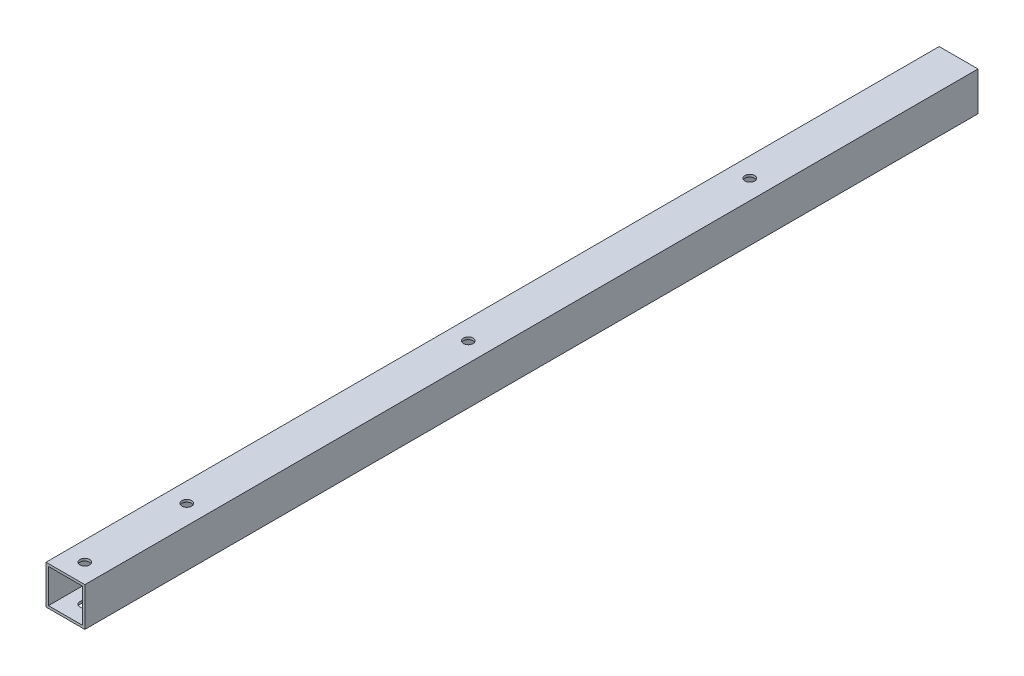
ISO-10303-21;
HEADER;
FILE_DESCRIPTION(('STEP AP214'),'2;1');
FILE_NAME('part.step','',(''),(''),'','','');
FILE_SCHEMA(('AUTOMOTIVE_DESIGN { 1 0 10303 214 1 1 1 1 }'));
ENDSEC;
DATA;
#1=APPLICATION_CONTEXT('core data for automotive mechanical design processes');
#2=APPLICATION_PROTOCOL_DEFINITION('international standard','automotive_design',2000,#1);
#3=PRODUCT_CONTEXT('',#1,'mechanical');
#4=PRODUCT('Part','Part','',(#3));
#5=PRODUCT_RELATED_PRODUCT_CATEGORY('part','',(#4));
#6=PRODUCT_DEFINITION_FORMATION('','',#4);
#7=PRODUCT_DEFINITION_CONTEXT('part definition',#1,'design');
#8=PRODUCT_DEFINITION('design','',#6,#7);
#9=PRODUCT_DEFINITION_SHAPE('','',#8);
#10=(LENGTH_UNIT() NAMED_UNIT(*) SI_UNIT(.MILLI.,.METRE.));
#11=(NAMED_UNIT(*) PLANE_ANGLE_UNIT() SI_UNIT($,.RADIAN.));
#12=(NAMED_UNIT(*) SI_UNIT($,.STERADIAN.) SOLID_ANGLE_UNIT());
#13=UNCERTAINTY_MEASURE_WITH_UNIT(LENGTH_MEASURE(1.E-05),#10,'distance_accuracy_value','');
#14=(GEOMETRIC_REPRESENTATION_CONTEXT(3) GLOBAL_UNCERTAINTY_ASSIGNED_CONTEXT((#13)) GLOBAL_UNIT_ASSIGNED_CONTEXT((#10,
#11,#12)) REPRESENTATION_CONTEXT('',''));
#15=CARTESIAN_POINT('',(0.,0.,0.));
#16=DIRECTION('',(0.,0.,1.));
#17=DIRECTION('',(1.,0.,0.));
#18=AXIS2_PLACEMENT_3D('',#15,#16,#17);
#19=CARTESIAN_POINT('',(-539.75,330.2,-50.8));
#20=DIRECTION('',(-1.,0.,0.));
#21=DIRECTION('',(0.,0.,1.));
#22=AXIS2_PLACEMENT_3D('',#19,#20,#21);
#23=PLANE('',#22);
#24=DIRECTION('',(0.,0.,1.));
#25=VECTOR('',#24,1.);
#26=CARTESIAN_POINT('',(-539.75,279.4,-50.8));
#27=LINE('',#26,#25);
#28=CARTESIAN_POINT('',(-539.75,279.4,-50.8));
#29=VERTEX_POINT('',#28);
#30=CARTESIAN_POINT('',(-539.75,279.4,1117.6));
#31=VERTEX_POINT('',#30);
#32=EDGE_CURVE('E188',#29,#31,#27,.T.);
#33=ORIENTED_EDGE('',*,*,#32,.T.);
#34=DIRECTION('',(0.,-1.,0.));
#35=VECTOR('',#34,1.);
#36=CARTESIAN_POINT('',(-539.75,330.2,1117.6));
#37=LINE('',#36,#35);
#38=CARTESIAN_POINT('',(-539.75,330.2,1117.6));
#39=VERTEX_POINT('',#38);
#40=EDGE_CURVE('E145',#39,#31,#37,.T.);
#41=ORIENTED_EDGE('',*,*,#40,.F.);
#42=DIRECTION('',(0.,0.,1.));
#43=VECTOR('',#42,1.);
#44=CARTESIAN_POINT('',(-539.75,330.2,-50.8));
#45=LINE('',#44,#43);
#46=CARTESIAN_POINT('',(-539.75,330.2,-50.8));
#47=VERTEX_POINT('',#46);
#48=EDGE_CURVE('E11',#47,#39,#45,.T.);
#49=ORIENTED_EDGE('',*,*,#48,.F.);
#50=DIRECTION('',(0.,-1.,0.));
#51=VECTOR('',#50,1.);
#52=CARTESIAN_POINT('',(-539.75,330.2,-50.8));
#53=LINE('',#52,#51);
#54=EDGE_CURVE('E170',#47,#29,#53,.T.);
#55=ORIENTED_EDGE('',*,*,#54,.T.);
#56=EDGE_LOOP('',(#33,#41,#49,#55));
#57=FACE_BOUND('',#56,.T.);
#58=ADVANCED_FACE('F38',(#57),#23,.T.);
#59=CARTESIAN_POINT('',(-539.75,330.2,-50.8));
#60=DIRECTION('',(0.,1.,0.));
#61=DIRECTION('',(0.,0.,1.));
#62=AXIS2_PLACEMENT_3D('',#59,#60,#61);
#63=PLANE('',#62);
#64=CARTESIAN_POINT('',(-514.35,330.2,222.25));
#65=DIRECTION('',(0.,1.,0.));
#66=DIRECTION('',(0.,0.,1.));
#67=AXIS2_PLACEMENT_3D('',#64,#65,#66);
#68=CIRCLE('',#67,6.34999999999994);
#69=CARTESIAN_POINT('',(-514.35,330.2,228.6));
#70=VERTEX_POINT('',#69);
#71=EDGE_CURVE('E383',#70,#70,#68,.T.);
#72=ORIENTED_EDGE('',*,*,#71,.F.);
#73=EDGE_LOOP('',(#72));
#74=FACE_BOUND('',#73,.T.);
#75=CARTESIAN_POINT('',(-514.35,330.2,590.55));
#76=DIRECTION('',(0.,1.,0.));
#77=DIRECTION('',(0.,0.,1.));
#78=AXIS2_PLACEMENT_3D('',#75,#76,#77);
#79=CIRCLE('',#78,6.34999999999994);
#80=CARTESIAN_POINT('',(-514.35,330.2,596.9));
#81=VERTEX_POINT('',#80);
#82=EDGE_CURVE('E219',#81,#81,#79,.T.);
#83=ORIENTED_EDGE('',*,*,#82,.F.);
#84=EDGE_LOOP('',(#83));
#85=FACE_BOUND('',#84,.T.);
#86=CARTESIAN_POINT('',(-514.35,330.2,958.85));
#87=DIRECTION('',(0.,1.,0.));
#88=DIRECTION('',(0.,0.,1.));
#89=AXIS2_PLACEMENT_3D('',#86,#87,#88);
#90=CIRCLE('',#89,6.34999999999994);
#91=CARTESIAN_POINT('',(-514.35,330.2,965.2));
#92=VERTEX_POINT('',#91);
#93=EDGE_CURVE('E216',#92,#92,#90,.T.);
#94=ORIENTED_EDGE('',*,*,#93,.F.);
#95=EDGE_LOOP('',(#94));
#96=FACE_BOUND('',#95,.T.);
#97=CARTESIAN_POINT('',(-514.35,330.2,1092.2));
#98=DIRECTION('',(0.,1.,0.));
#99=DIRECTION('',(0.,0.,1.));
#100=AXIS2_PLACEMENT_3D('',#97,#98,#99);
#101=CIRCLE('',#100,6.34999999999994);
#102=CARTESIAN_POINT('',(-514.35,330.2,1098.55));
#103=VERTEX_POINT('',#102);
#104=EDGE_CURVE('E238',#103,#103,#101,.T.);
#105=ORIENTED_EDGE('',*,*,#104,.F.);
#106=EDGE_LOOP('',(#105));
#107=FACE_BOUND('',#106,.T.);
#108=ORIENTED_EDGE('',*,*,#48,.T.);
#109=DIRECTION('',(-1.,0.,0.));
#110=VECTOR('',#109,1.);
#111=CARTESIAN_POINT('',(-539.75,330.2,1117.6));
#112=LINE('',#111,#110);
#113=CARTESIAN_POINT('',(-488.95,330.2,1117.6));
#114=VERTEX_POINT('',#113);
#115=EDGE_CURVE('E155',#114,#39,#112,.T.);
#116=ORIENTED_EDGE('',*,*,#115,.F.);
#117=DIRECTION('',(0.,0.,1.));
#118=VECTOR('',#117,1.);
#119=CARTESIAN_POINT('',(-488.95,330.2,-50.8));
#120=LINE('',#119,#118);
#121=CARTESIAN_POINT('',(-488.95,330.2,-50.8));
#122=VERTEX_POINT('',#121);
#123=EDGE_CURVE('E47',#122,#114,#120,.T.);
#124=ORIENTED_EDGE('',*,*,#123,.F.);
#125=DIRECTION('',(-1.,0.,0.));
#126=VECTOR('',#125,1.);
#127=CARTESIAN_POINT('',(-539.75,330.2,-50.8));
#128=LINE('',#127,#126);
#129=EDGE_CURVE('E186',#122,#47,#128,.T.);
#130=ORIENTED_EDGE('',*,*,#129,.T.);
#131=EDGE_LOOP('',(#108,#116,#124,#130));
#132=FACE_BOUND('',#131,.T.);
#133=ADVANCED_FACE('F265',(#74,#85,#96,#107,#132),#63,.T.);
#134=CARTESIAN_POINT('',(-488.95,330.2,-50.8));
#135=DIRECTION('',(1.,0.,0.));
#136=DIRECTION('',(0.,0.,-1.));
#137=AXIS2_PLACEMENT_3D('',#134,#135,#136);
#138=PLANE('',#137);
#139=ORIENTED_EDGE('',*,*,#123,.T.);
#140=DIRECTION('',(0.,1.,0.));
#141=VECTOR('',#140,1.);
#142=CARTESIAN_POINT('',(-488.95,330.2,1117.6));
#143=LINE('',#142,#141);
#144=CARTESIAN_POINT('',(-488.95,279.4,1117.6));
#145=VERTEX_POINT('',#144);
#146=EDGE_CURVE('E151',#145,#114,#143,.T.);
#147=ORIENTED_EDGE('',*,*,#146,.F.);
#148=DIRECTION('',(0.,0.,1.));
#149=VECTOR('',#148,1.);
#150=CARTESIAN_POINT('',(-488.95,279.4,-50.8));
#151=LINE('',#150,#149);
#152=CARTESIAN_POINT('',(-488.95,279.4,-50.8));
#153=VERTEX_POINT('',#152);
#154=EDGE_CURVE('E192',#153,#145,#151,.T.);
#155=ORIENTED_EDGE('',*,*,#154,.F.);
#156=DIRECTION('',(0.,1.,0.));
#157=VECTOR('',#156,1.);
#158=CARTESIAN_POINT('',(-488.95,330.2,-50.8));
#159=LINE('',#158,#157);
#160=EDGE_CURVE('E182',#153,#122,#159,.T.);
#161=ORIENTED_EDGE('',*,*,#160,.T.);
#162=EDGE_LOOP('',(#139,#147,#155,#161));
#163=FACE_BOUND('',#162,.T.);
#164=ADVANCED_FACE('F269',(#163),#138,.T.);
#165=CARTESIAN_POINT('',(-539.75,279.4,-50.8));
#166=DIRECTION('',(0.,-1.,0.));
#167=DIRECTION('',(0.,0.,-1.));
#168=AXIS2_PLACEMENT_3D('',#165,#166,#167);
#169=PLANE('',#168);
#170=CARTESIAN_POINT('',(-514.35,279.4,222.25));
#171=DIRECTION('',(0.,1.,0.));
#172=DIRECTION('',(0.,0.,1.));
#173=AXIS2_PLACEMENT_3D('',#170,#171,#172);
#174=CIRCLE('',#173,6.34999999999994);
#175=CARTESIAN_POINT('',(-514.35,279.4,228.6));
#176=VERTEX_POINT('',#175);
#177=EDGE_CURVE('E389',#176,#176,#174,.T.);
#178=ORIENTED_EDGE('',*,*,#177,.T.);
#179=EDGE_LOOP('',(#178));
#180=FACE_BOUND('',#179,.T.);
#181=CARTESIAN_POINT('',(-514.35,279.4,590.55));
#182=DIRECTION('',(0.,1.,0.));
#183=DIRECTION('',(0.,0.,1.));
#184=AXIS2_PLACEMENT_3D('',#181,#182,#183);
#185=CIRCLE('',#184,6.34999999999994);
#186=CARTESIAN_POINT('',(-514.35,279.4,596.9));
#187=VERTEX_POINT('',#186);
#188=EDGE_CURVE('E209',#187,#187,#185,.T.);
#189=ORIENTED_EDGE('',*,*,#188,.T.);
#190=EDGE_LOOP('',(#189));
#191=FACE_BOUND('',#190,.T.);
#192=CARTESIAN_POINT('',(-514.35,279.4,958.85));
#193=DIRECTION('',(0.,1.,0.));
#194=DIRECTION('',(0.,0.,1.));
#195=AXIS2_PLACEMENT_3D('',#192,#193,#194);
#196=CIRCLE('',#195,6.34999999999994);
#197=CARTESIAN_POINT('',(-514.35,279.4,965.2));
#198=VERTEX_POINT('',#197);
#199=EDGE_CURVE('E204',#198,#198,#196,.T.);
#200=ORIENTED_EDGE('',*,*,#199,.T.);
#201=EDGE_LOOP('',(#200));
#202=FACE_BOUND('',#201,.T.);
#203=CARTESIAN_POINT('',(-514.35,279.4,1092.2));
#204=DIRECTION('',(0.,1.,0.));
#205=DIRECTION('',(0.,0.,1.));
#206=AXIS2_PLACEMENT_3D('',#203,#204,#205);
#207=CIRCLE('',#206,6.34999999999994);
#208=CARTESIAN_POINT('',(-514.35,279.4,1098.55));
#209=VERTEX_POINT('',#208);
#210=EDGE_CURVE('E200',#209,#209,#207,.T.);
#211=ORIENTED_EDGE('',*,*,#210,.T.);
#212=EDGE_LOOP('',(#211));
#213=FACE_BOUND('',#212,.T.);
#214=ORIENTED_EDGE('',*,*,#154,.T.);
#215=DIRECTION('',(1.,0.,0.));
#216=VECTOR('',#215,1.);
#217=CARTESIAN_POINT('',(-539.75,279.4,1117.6));
#218=LINE('',#217,#216);
#219=EDGE_CURVE('E148',#31,#145,#218,.T.);
#220=ORIENTED_EDGE('',*,*,#219,.F.);
#221=ORIENTED_EDGE('',*,*,#32,.F.);
#222=DIRECTION('',(1.,0.,0.));
#223=VECTOR('',#222,1.);
#224=CARTESIAN_POINT('',(-539.75,279.4,-50.8));
#225=LINE('',#224,#223);
#226=EDGE_CURVE('E178',#29,#153,#225,.T.);
#227=ORIENTED_EDGE('',*,*,#226,.T.);
#228=EDGE_LOOP('',(#214,#220,#221,#227));
#229=FACE_BOUND('',#228,.T.);
#230=ADVANCED_FACE('F275',(#180,#191,#202,#213,#229),#169,.T.);
#231=CARTESIAN_POINT('',(-539.75,279.4,-50.8));
#232=DIRECTION('',(0.,0.,1.));
#233=DIRECTION('',(1.,0.,0.));
#234=AXIS2_PLACEMENT_3D('',#231,#232,#233);
#235=PLANE('',#234);
#236=DIRECTION('',(-1.,0.,0.));
#237=VECTOR('',#236,1.);
#238=CARTESIAN_POINT('',(-536.575,327.025,-50.8));
#239=LINE('',#238,#237);
#240=CARTESIAN_POINT('',(-492.125,327.025,-50.8));
#241=VERTEX_POINT('',#240);
#242=CARTESIAN_POINT('',(-536.575,327.025,-50.8));
#243=VERTEX_POINT('',#242);
#244=EDGE_CURVE('E123',#241,#243,#239,.T.);
#245=ORIENTED_EDGE('',*,*,#244,.T.);
#246=DIRECTION('',(0.,-1.,0.));
#247=VECTOR('',#246,1.);
#248=CARTESIAN_POINT('',(-536.575,327.025,-50.8));
#249=LINE('',#248,#247);
#250=CARTESIAN_POINT('',(-536.575,282.575,-50.8));
#251=VERTEX_POINT('',#250);
#252=EDGE_CURVE('E159',#243,#251,#249,.T.);
#253=ORIENTED_EDGE('',*,*,#252,.T.);
#254=DIRECTION('',(1.,0.,0.));
#255=VECTOR('',#254,1.);
#256=CARTESIAN_POINT('',(-536.575,282.575,-50.8));
#257=LINE('',#256,#255);
#258=CARTESIAN_POINT('',(-492.125,282.575,-50.8));
#259=VERTEX_POINT('',#258);
#260=EDGE_CURVE('E117',#251,#259,#257,.T.);
#261=ORIENTED_EDGE('',*,*,#260,.T.);
#262=DIRECTION('',(0.,1.,0.));
#263=VECTOR('',#262,1.);
#264=CARTESIAN_POINT('',(-492.125,327.025,-50.8));
#265=LINE('',#264,#263);
#266=EDGE_CURVE('E58',#259,#241,#265,.T.);
#267=ORIENTED_EDGE('',*,*,#266,.T.);
#268=EDGE_LOOP('',(#245,#253,#261,#267));
#269=FACE_BOUND('',#268,.T.);
#270=ORIENTED_EDGE('',*,*,#54,.F.);
#271=ORIENTED_EDGE('',*,*,#129,.F.);
#272=ORIENTED_EDGE('',*,*,#160,.F.);
#273=ORIENTED_EDGE('',*,*,#226,.F.);
#274=EDGE_LOOP('',(#270,#271,#272,#273));
#275=FACE_BOUND('',#274,.T.);
#276=ADVANCED_FACE('F283',(#269,#275),#235,.F.);
#277=CARTESIAN_POINT('',(-536.575,327.025,-50.8));
#278=DIRECTION('',(-1.,0.,0.));
#279=DIRECTION('',(0.,0.,1.));
#280=AXIS2_PLACEMENT_3D('',#277,#278,#279);
#281=PLANE('',#280);
#282=DIRECTION('',(0.,0.,1.));
#283=VECTOR('',#282,1.);
#284=CARTESIAN_POINT('',(-536.575,327.025,-50.8));
#285=LINE('',#284,#283);
#286=CARTESIAN_POINT('',(-536.575,327.025,1117.6));
#287=VERTEX_POINT('',#286);
#288=EDGE_CURVE('E128',#243,#287,#285,.T.);
#289=ORIENTED_EDGE('',*,*,#288,.T.);
#290=DIRECTION('',(0.,-1.,0.));
#291=VECTOR('',#290,1.);
#292=CARTESIAN_POINT('',(-536.575,327.025,1117.6));
#293=LINE('',#292,#291);
#294=CARTESIAN_POINT('',(-536.575,282.575,1117.6));
#295=VERTEX_POINT('',#294);
#296=EDGE_CURVE('E126',#287,#295,#293,.T.);
#297=ORIENTED_EDGE('',*,*,#296,.T.);
#298=DIRECTION('',(0.,0.,1.));
#299=VECTOR('',#298,1.);
#300=CARTESIAN_POINT('',(-536.575,282.575,-50.8));
#301=LINE('',#300,#299);
#302=EDGE_CURVE('E110',#251,#295,#301,.T.);
#303=ORIENTED_EDGE('',*,*,#302,.F.);
#304=ORIENTED_EDGE('',*,*,#252,.F.);
#305=EDGE_LOOP('',(#289,#297,#303,#304));
#306=FACE_BOUND('',#305,.T.);
#307=ADVANCED_FACE('F127',(#306),#281,.F.);
#308=CARTESIAN_POINT('',(-536.575,327.025,-50.8));
#309=DIRECTION('',(0.,1.,0.));
#310=DIRECTION('',(0.,0.,1.));
#311=AXIS2_PLACEMENT_3D('',#308,#309,#310);
#312=PLANE('',#311);
#313=CARTESIAN_POINT('',(-514.35,327.025,222.25));
#314=DIRECTION('',(0.,1.,0.));
#315=DIRECTION('',(0.,0.,1.));
#316=AXIS2_PLACEMENT_3D('',#313,#314,#315);
#317=CIRCLE('',#316,6.34999999999994);
#318=CARTESIAN_POINT('',(-514.35,327.025,228.6));
#319=VERTEX_POINT('',#318);
#320=EDGE_CURVE('E225',#319,#319,#317,.T.);
#321=ORIENTED_EDGE('',*,*,#320,.T.);
#322=EDGE_LOOP('',(#321));
#323=FACE_BOUND('',#322,.T.);
#324=CARTESIAN_POINT('',(-514.35,327.025,590.55));
#325=DIRECTION('',(0.,1.,0.));
#326=DIRECTION('',(0.,0.,1.));
#327=AXIS2_PLACEMENT_3D('',#324,#325,#326);
#328=CIRCLE('',#327,6.34999999999994);
#329=CARTESIAN_POINT('',(-514.35,327.025,596.9));
#330=VERTEX_POINT('',#329);
#331=EDGE_CURVE('E208',#330,#330,#328,.T.);
#332=ORIENTED_EDGE('',*,*,#331,.T.);
#333=EDGE_LOOP('',(#332));
#334=FACE_BOUND('',#333,.T.);
#335=CARTESIAN_POINT('',(-514.35,327.025,958.85));
#336=DIRECTION('',(0.,1.,0.));
#337=DIRECTION('',(0.,0.,1.));
#338=AXIS2_PLACEMENT_3D('',#335,#336,#337);
#339=CIRCLE('',#338,6.34999999999994);
#340=CARTESIAN_POINT('',(-514.35,327.025,965.2));
#341=VERTEX_POINT('',#340);
#342=EDGE_CURVE('E203',#341,#341,#339,.T.);
#343=ORIENTED_EDGE('',*,*,#342,.T.);
#344=EDGE_LOOP('',(#343));
#345=FACE_BOUND('',#344,.T.);
#346=CARTESIAN_POINT('',(-514.35,327.025,1092.2));
#347=DIRECTION('',(0.,1.,0.));
#348=DIRECTION('',(0.,0.,1.));
#349=AXIS2_PLACEMENT_3D('',#346,#347,#348);
#350=CIRCLE('',#349,6.34999999999994);
#351=CARTESIAN_POINT('',(-514.35,327.025,1098.55));
#352=VERTEX_POINT('',#351);
#353=EDGE_CURVE('E132',#352,#352,#350,.T.);
#354=ORIENTED_EDGE('',*,*,#353,.T.);
#355=EDGE_LOOP('',(#354));
#356=FACE_BOUND('',#355,.T.);
#357=DIRECTION('',(0.,0.,1.));
#358=VECTOR('',#357,1.);
#359=CARTESIAN_POINT('',(-492.125,327.025,-50.8));
#360=LINE('',#359,#358);
#361=CARTESIAN_POINT('',(-492.125,327.025,1117.6));
#362=VERTEX_POINT('',#361);
#363=EDGE_CURVE('E171',#241,#362,#360,.T.);
#364=ORIENTED_EDGE('',*,*,#363,.T.);
#365=DIRECTION('',(-1.,0.,0.));
#366=VECTOR('',#365,1.);
#367=CARTESIAN_POINT('',(-536.575,327.025,1117.6));
#368=LINE('',#367,#366);
#369=EDGE_CURVE('E139',#362,#287,#368,.T.);
#370=ORIENTED_EDGE('',*,*,#369,.T.);
#371=ORIENTED_EDGE('',*,*,#288,.F.);
#372=ORIENTED_EDGE('',*,*,#244,.F.);
#373=EDGE_LOOP('',(#364,#370,#371,#372));
#374=FACE_BOUND('',#373,.T.);
#375=ADVANCED_FACE('F246',(#323,#334,#345,#356,#374),#312,.F.);
#376=CARTESIAN_POINT('',(-492.125,327.025,-50.8));
#377=DIRECTION('',(1.,0.,0.));
#378=DIRECTION('',(0.,0.,-1.));
#379=AXIS2_PLACEMENT_3D('',#376,#377,#378);
#380=PLANE('',#379);
#381=DIRECTION('',(0.,0.,1.));
#382=VECTOR('',#381,1.);
#383=CARTESIAN_POINT('',(-492.125,282.575,-50.8));
#384=LINE('',#383,#382);
#385=CARTESIAN_POINT('',(-492.125,282.575,1117.6));
#386=VERTEX_POINT('',#385);
#387=EDGE_CURVE('E122',#259,#386,#384,.T.);
#388=ORIENTED_EDGE('',*,*,#387,.T.);
#389=DIRECTION('',(0.,1.,0.));
#390=VECTOR('',#389,1.);
#391=CARTESIAN_POINT('',(-492.125,327.025,1117.6));
#392=LINE('',#391,#390);
#393=EDGE_CURVE('E136',#386,#362,#392,.T.);
#394=ORIENTED_EDGE('',*,*,#393,.T.);
#395=ORIENTED_EDGE('',*,*,#363,.F.);
#396=ORIENTED_EDGE('',*,*,#266,.F.);
#397=EDGE_LOOP('',(#388,#394,#395,#396));
#398=FACE_BOUND('',#397,.T.);
#399=ADVANCED_FACE('F299',(#398),#380,.F.);
#400=CARTESIAN_POINT('',(-536.575,282.575,-50.8));
#401=DIRECTION('',(0.,-1.,0.));
#402=DIRECTION('',(0.,0.,-1.));
#403=AXIS2_PLACEMENT_3D('',#400,#401,#402);
#404=PLANE('',#403);
#405=CARTESIAN_POINT('',(-514.35,282.575,222.25));
#406=DIRECTION('',(0.,-1.,0.));
#407=DIRECTION('',(0.,0.,-1.));
#408=AXIS2_PLACEMENT_3D('',#405,#406,#407);
#409=CIRCLE('',#408,6.34999999999994);
#410=CARTESIAN_POINT('',(-514.35,282.575,215.9));
#411=VERTEX_POINT('',#410);
#412=EDGE_CURVE('E41',#411,#411,#409,.T.);
#413=ORIENTED_EDGE('',*,*,#412,.T.);
#414=EDGE_LOOP('',(#413));
#415=FACE_BOUND('',#414,.T.);
#416=CARTESIAN_POINT('',(-514.35,282.575,590.55));
#417=DIRECTION('',(0.,-1.,0.));
#418=DIRECTION('',(0.,0.,-1.));
#419=AXIS2_PLACEMENT_3D('',#416,#417,#418);
#420=CIRCLE('',#419,6.34999999999994);
#421=CARTESIAN_POINT('',(-514.35,282.575,584.2));
#422=VERTEX_POINT('',#421);
#423=EDGE_CURVE('E205',#422,#422,#420,.T.);
#424=ORIENTED_EDGE('',*,*,#423,.T.);
#425=EDGE_LOOP('',(#424));
#426=FACE_BOUND('',#425,.T.);
#427=CARTESIAN_POINT('',(-514.35,282.575,958.85));
#428=DIRECTION('',(0.,-1.,0.));
#429=DIRECTION('',(0.,0.,-1.));
#430=AXIS2_PLACEMENT_3D('',#427,#428,#429);
#431=CIRCLE('',#430,6.34999999999994);
#432=CARTESIAN_POINT('',(-514.35,282.575,952.5));
#433=VERTEX_POINT('',#432);
#434=EDGE_CURVE('E201',#433,#433,#431,.T.);
#435=ORIENTED_EDGE('',*,*,#434,.T.);
#436=EDGE_LOOP('',(#435));
#437=FACE_BOUND('',#436,.T.);
#438=CARTESIAN_POINT('',(-514.35,282.575,1092.2));
#439=DIRECTION('',(0.,-1.,0.));
#440=DIRECTION('',(0.,0.,-1.));
#441=AXIS2_PLACEMENT_3D('',#438,#439,#440);
#442=CIRCLE('',#441,6.34999999999994);
#443=CARTESIAN_POINT('',(-514.35,282.575,1085.85));
#444=VERTEX_POINT('',#443);
#445=EDGE_CURVE('E197',#444,#444,#442,.T.);
#446=ORIENTED_EDGE('',*,*,#445,.T.);
#447=EDGE_LOOP('',(#446));
#448=FACE_BOUND('',#447,.T.);
#449=ORIENTED_EDGE('',*,*,#302,.T.);
#450=DIRECTION('',(1.,0.,0.));
#451=VECTOR('',#450,1.);
#452=CARTESIAN_POINT('',(-536.575,282.575,1117.6));
#453=LINE('',#452,#451);
#454=EDGE_CURVE('E114',#295,#386,#453,.T.);
#455=ORIENTED_EDGE('',*,*,#454,.T.);
#456=ORIENTED_EDGE('',*,*,#387,.F.);
#457=ORIENTED_EDGE('',*,*,#260,.F.);
#458=EDGE_LOOP('',(#449,#455,#456,#457));
#459=FACE_BOUND('',#458,.T.);
#460=ADVANCED_FACE('F112',(#415,#426,#437,#448,#459),#404,.F.);
#461=CARTESIAN_POINT('',(-539.75,279.4,1117.6));
#462=DIRECTION('',(0.,0.,1.));
#463=DIRECTION('',(1.,0.,0.));
#464=AXIS2_PLACEMENT_3D('',#461,#462,#463);
#465=PLANE('',#464);
#466=ORIENTED_EDGE('',*,*,#40,.T.);
#467=ORIENTED_EDGE('',*,*,#219,.T.);
#468=ORIENTED_EDGE('',*,*,#146,.T.);
#469=ORIENTED_EDGE('',*,*,#115,.T.);
#470=EDGE_LOOP('',(#466,#467,#468,#469));
#471=FACE_BOUND('',#470,.T.);
#472=ORIENTED_EDGE('',*,*,#454,.F.);
#473=ORIENTED_EDGE('',*,*,#296,.F.);
#474=ORIENTED_EDGE('',*,*,#369,.F.);
#475=ORIENTED_EDGE('',*,*,#393,.F.);
#476=EDGE_LOOP('',(#472,#473,#474,#475));
#477=FACE_BOUND('',#476,.T.);
#478=ADVANCED_FACE('F134',(#471,#477),#465,.T.);
#479=CARTESIAN_POINT('',(-514.35,279.4,1092.2));
#480=DIRECTION('',(0.,1.,0.));
#481=DIRECTION('',(0.,0.,1.));
#482=AXIS2_PLACEMENT_3D('',#479,#480,#481);
#483=CYLINDRICAL_SURFACE('',#482,6.34999999999994);
#484=ORIENTED_EDGE('',*,*,#210,.F.);
#485=EDGE_LOOP('',(#484));
#486=FACE_BOUND('',#485,.T.);
#487=ORIENTED_EDGE('',*,*,#445,.F.);
#488=EDGE_LOOP('',(#487));
#489=FACE_BOUND('',#488,.T.);
#490=ADVANCED_FACE('F252',(#486,#489),#483,.F.);
#491=ORIENTED_EDGE('',*,*,#104,.T.);
#492=EDGE_LOOP('',(#491));
#493=FACE_BOUND('',#492,.T.);
#494=ORIENTED_EDGE('',*,*,#353,.F.);
#495=EDGE_LOOP('',(#494));
#496=FACE_BOUND('',#495,.T.);
#497=ADVANCED_FACE('F249',(#493,#496),#483,.F.);
#498=CARTESIAN_POINT('',(-514.35,279.4,958.85));
#499=DIRECTION('',(0.,1.,0.));
#500=DIRECTION('',(0.,0.,1.));
#501=AXIS2_PLACEMENT_3D('',#498,#499,#500);
#502=CYLINDRICAL_SURFACE('',#501,6.34999999999994);
#503=ORIENTED_EDGE('',*,*,#199,.F.);
#504=EDGE_LOOP('',(#503));
#505=FACE_BOUND('',#504,.T.);
#506=ORIENTED_EDGE('',*,*,#434,.F.);
#507=EDGE_LOOP('',(#506));
#508=FACE_BOUND('',#507,.T.);
#509=ADVANCED_FACE('F251',(#505,#508),#502,.F.);
#510=ORIENTED_EDGE('',*,*,#93,.T.);
#511=EDGE_LOOP('',(#510));
#512=FACE_BOUND('',#511,.T.);
#513=ORIENTED_EDGE('',*,*,#342,.F.);
#514=EDGE_LOOP('',(#513));
#515=FACE_BOUND('',#514,.T.);
#516=ADVANCED_FACE('F259',(#512,#515),#502,.F.);
#517=CARTESIAN_POINT('',(-514.35,279.4,590.55));
#518=DIRECTION('',(0.,1.,0.));
#519=DIRECTION('',(0.,0.,1.));
#520=AXIS2_PLACEMENT_3D('',#517,#518,#519);
#521=CYLINDRICAL_SURFACE('',#520,6.34999999999994);
#522=ORIENTED_EDGE('',*,*,#188,.F.);
#523=EDGE_LOOP('',(#522));
#524=FACE_BOUND('',#523,.T.);
#525=ORIENTED_EDGE('',*,*,#423,.F.);
#526=EDGE_LOOP('',(#525));
#527=FACE_BOUND('',#526,.T.);
#528=ADVANCED_FACE('F339',(#524,#527),#521,.F.);
#529=ORIENTED_EDGE('',*,*,#82,.T.);
#530=EDGE_LOOP('',(#529));
#531=FACE_BOUND('',#530,.T.);
#532=ORIENTED_EDGE('',*,*,#331,.F.);
#533=EDGE_LOOP('',(#532));
#534=FACE_BOUND('',#533,.T.);
#535=ADVANCED_FACE('F348',(#531,#534),#521,.F.);
#536=CARTESIAN_POINT('',(-514.35,279.4,222.25));
#537=DIRECTION('',(0.,1.,0.));
#538=DIRECTION('',(0.,0.,1.));
#539=AXIS2_PLACEMENT_3D('',#536,#537,#538);
#540=CYLINDRICAL_SURFACE('',#539,6.34999999999994);
#541=ORIENTED_EDGE('',*,*,#177,.F.);
#542=EDGE_LOOP('',(#541));
#543=FACE_BOUND('',#542,.T.);
#544=ORIENTED_EDGE('',*,*,#412,.F.);
#545=EDGE_LOOP('',(#544));
#546=FACE_BOUND('',#545,.T.);
#547=ADVANCED_FACE('F358',(#543,#546),#540,.F.);
#548=ORIENTED_EDGE('',*,*,#71,.T.);
#549=EDGE_LOOP('',(#548));
#550=FACE_BOUND('',#549,.T.);
#551=ORIENTED_EDGE('',*,*,#320,.F.);
#552=EDGE_LOOP('',(#551));
#553=FACE_BOUND('',#552,.T.);
#554=ADVANCED_FACE('F367',(#550,#553),#540,.F.);
#555=CLOSED_SHELL('',(#58,#133,#164,#230,#276,#307,#375,#399,#460,#478,#490,#497,#509,#516,#528,
#535,#547,#554));
#556=MANIFOLD_SOLID_BREP('B2',#555);
#557=ADVANCED_BREP_SHAPE_REPRESENTATION('',(#18,#556),#14);
#558=SHAPE_DEFINITION_REPRESENTATION(#9,#557);
ENDSEC;
END-ISO-10303-21;
